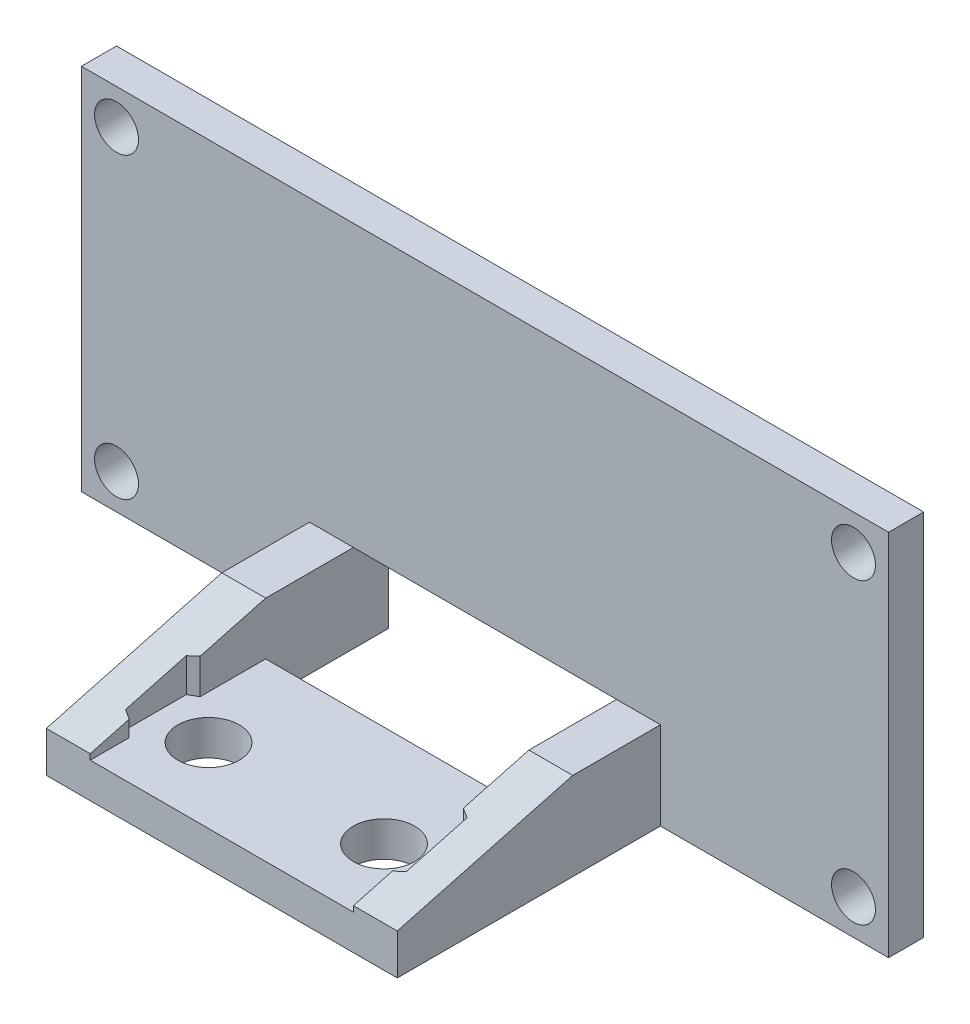
ISO-10303-21;
HEADER;
FILE_DESCRIPTION(('STEP AP214'),'2;1');
FILE_NAME('part.step','',(''),(''),'','','');
FILE_SCHEMA(('AUTOMOTIVE_DESIGN { 1 0 10303 214 1 1 1 1 }'));
ENDSEC;
DATA;
#1=APPLICATION_CONTEXT('core data for automotive mechanical design processes');
#2=APPLICATION_PROTOCOL_DEFINITION('international standard','automotive_design',2000,#1);
#3=PRODUCT_CONTEXT('',#1,'mechanical');
#4=PRODUCT('Part','Part','',(#3));
#5=PRODUCT_RELATED_PRODUCT_CATEGORY('part','',(#4));
#6=PRODUCT_DEFINITION_FORMATION('','',#4);
#7=PRODUCT_DEFINITION_CONTEXT('part definition',#1,'design');
#8=PRODUCT_DEFINITION('design','',#6,#7);
#9=PRODUCT_DEFINITION_SHAPE('','',#8);
#10=(LENGTH_UNIT() NAMED_UNIT(*) SI_UNIT(.MILLI.,.METRE.));
#11=(NAMED_UNIT(*) PLANE_ANGLE_UNIT() SI_UNIT($,.RADIAN.));
#12=(NAMED_UNIT(*) SI_UNIT($,.STERADIAN.) SOLID_ANGLE_UNIT());
#13=UNCERTAINTY_MEASURE_WITH_UNIT(LENGTH_MEASURE(1.E-05),#10,'distance_accuracy_value','');
#14=(GEOMETRIC_REPRESENTATION_CONTEXT(3) GLOBAL_UNCERTAINTY_ASSIGNED_CONTEXT((#13)) GLOBAL_UNIT_ASSIGNED_CONTEXT((#10,
#11,#12)) REPRESENTATION_CONTEXT('',''));
#15=CARTESIAN_POINT('',(0.,0.,0.));
#16=DIRECTION('',(0.,0.,1.));
#17=DIRECTION('',(1.,0.,0.));
#18=AXIS2_PLACEMENT_3D('',#15,#16,#17);
#19=CARTESIAN_POINT('',(7.5,0.,2.));
#20=DIRECTION('',(1.,0.,0.));
#21=DIRECTION('',(0.,1.,0.));
#22=AXIS2_PLACEMENT_3D('',#19,#20,#21);
#23=PLANE('',#22);
#24=DIRECTION('',(0.,1.,0.));
#25=VECTOR('',#24,1.);
#26=CARTESIAN_POINT('',(7.5,0.,14.7766332552221));
#27=LINE('',#26,#25);
#28=CARTESIAN_POINT('',(7.5,-8.5,14.7766332552221));
#29=VERTEX_POINT('',#28);
#30=CARTESIAN_POINT('',(7.5,-7.5837426005698,14.7766332552221));
#31=VERTEX_POINT('',#30);
#32=EDGE_CURVE('E271',#29,#31,#27,.T.);
#33=ORIENTED_EDGE('',*,*,#32,.F.);
#34=DIRECTION('',(0.,0.,1.));
#35=VECTOR('',#34,1.);
#36=CARTESIAN_POINT('',(7.5,-8.5,7.));
#37=LINE('',#36,#35);
#38=CARTESIAN_POINT('',(7.5,-8.5,17.));
#39=VERTEX_POINT('',#38);
#40=EDGE_CURVE('E232',#29,#39,#37,.T.);
#41=ORIENTED_EDGE('',*,*,#40,.T.);
#42=DIRECTION('',(0.,-1.,0.));
#43=VECTOR('',#42,1.);
#44=CARTESIAN_POINT('',(7.5,-10.5,17.));
#45=LINE('',#44,#43);
#46=CARTESIAN_POINT('',(7.5,-8.17949192431123,17.));
#47=VERTEX_POINT('',#46);
#48=EDGE_CURVE('E366',#47,#39,#45,.T.);
#49=ORIENTED_EDGE('',*,*,#48,.F.);
#50=DIRECTION('',(0.,-0.258819045102518,0.965925826289069));
#51=VECTOR('',#50,1.);
#52=CARTESIAN_POINT('',(7.5,-8.17949192431123,17.));
#53=LINE('',#52,#51);
#54=EDGE_CURVE('E486',#47,#31,#53,.F.);
#55=ORIENTED_EDGE('',*,*,#54,.T.);
#56=EDGE_LOOP('',(#33,#41,#49,#55));
#57=FACE_BOUND('',#56,.T.);
#58=ADVANCED_FACE('F45',(#57),#23,.F.);
#59=DIRECTION('',(0.,-1.,0.));
#60=VECTOR('',#59,1.);
#61=CARTESIAN_POINT('',(7.5,0.,10.7351813708948));
#62=LINE('',#61,#60);
#63=CARTESIAN_POINT('',(7.5,-6.50083883191505,10.7351813708947));
#64=VERTEX_POINT('',#63);
#65=CARTESIAN_POINT('',(7.5,-8.5,10.7351813708948));
#66=VERTEX_POINT('',#65);
#67=EDGE_CURVE('E268',#64,#66,#62,.T.);
#68=ORIENTED_EDGE('',*,*,#67,.F.);
#69=CARTESIAN_POINT('',(7.5,-5.5,6.99999999999987));
#70=VERTEX_POINT('',#69);
#71=EDGE_CURVE('E485',#64,#70,#53,.F.);
#72=ORIENTED_EDGE('',*,*,#71,.T.);
#73=DIRECTION('',(0.,0.,-1.));
#74=VECTOR('',#73,1.);
#75=CARTESIAN_POINT('',(7.5,-5.5,17.));
#76=LINE('',#75,#74);
#77=CARTESIAN_POINT('',(7.5,-5.5,2.));
#78=VERTEX_POINT('',#77);
#79=EDGE_CURVE('E357',#70,#78,#76,.T.);
#80=ORIENTED_EDGE('',*,*,#79,.T.);
#81=DIRECTION('',(0.,0.,-1.));
#82=VECTOR('',#81,1.);
#83=CARTESIAN_POINT('',(7.5,-5.5,2.));
#84=LINE('',#83,#82);
#85=CARTESIAN_POINT('',(7.5,-5.5,0.));
#86=VERTEX_POINT('',#85);
#87=EDGE_CURVE('E473',#78,#86,#84,.T.);
#88=ORIENTED_EDGE('',*,*,#87,.T.);
#89=DIRECTION('',(0.,-1.,0.));
#90=VECTOR('',#89,1.);
#91=CARTESIAN_POINT('',(7.5,0.,0.));
#92=LINE('',#91,#90);
#93=CARTESIAN_POINT('',(7.5,-10.5,0.));
#94=VERTEX_POINT('',#93);
#95=EDGE_CURVE('E428',#86,#94,#92,.T.);
#96=ORIENTED_EDGE('',*,*,#95,.T.);
#97=DIRECTION('',(0.,0.,-1.));
#98=VECTOR('',#97,1.);
#99=CARTESIAN_POINT('',(7.5,-10.5,2.));
#100=LINE('',#99,#98);
#101=CARTESIAN_POINT('',(7.5,-10.5,7.));
#102=VERTEX_POINT('',#101);
#103=EDGE_CURVE('E470',#102,#94,#100,.T.);
#104=ORIENTED_EDGE('',*,*,#103,.F.);
#105=DIRECTION('',(0.,1.,0.));
#106=VECTOR('',#105,1.);
#107=CARTESIAN_POINT('',(7.5,-10.5,7.));
#108=LINE('',#107,#106);
#109=CARTESIAN_POINT('',(7.5,-8.5,7.));
#110=VERTEX_POINT('',#109);
#111=EDGE_CURVE('E331',#102,#110,#108,.T.);
#112=ORIENTED_EDGE('',*,*,#111,.T.);
#113=EDGE_CURVE('E348',#110,#66,#37,.T.);
#114=ORIENTED_EDGE('',*,*,#113,.T.);
#115=EDGE_LOOP('',(#68,#72,#80,#88,#96,#104,#112,#114));
#116=FACE_BOUND('',#115,.T.);
#117=ADVANCED_FACE('F530',(#116),#23,.F.);
#118=CARTESIAN_POINT('',(-7.5,0.,2.));
#119=DIRECTION('',(1.,0.,0.));
#120=DIRECTION('',(0.,0.,-1.));
#121=AXIS2_PLACEMENT_3D('',#118,#119,#120);
#122=PLANE('',#121);
#123=DIRECTION('',(0.,0.,1.));
#124=VECTOR('',#123,1.);
#125=CARTESIAN_POINT('',(-7.5,-8.5,7.));
#126=LINE('',#125,#124);
#127=CARTESIAN_POINT('',(-7.5,-8.5,14.7766332552221));
#128=VERTEX_POINT('',#127);
#129=CARTESIAN_POINT('',(-7.5,-8.5,17.));
#130=VERTEX_POINT('',#129);
#131=EDGE_CURVE('E347',#128,#130,#126,.T.);
#132=ORIENTED_EDGE('',*,*,#131,.F.);
#133=DIRECTION('',(0.,1.,0.));
#134=VECTOR('',#133,1.);
#135=CARTESIAN_POINT('',(-7.5,0.,14.7766332552221));
#136=LINE('',#135,#134);
#137=CARTESIAN_POINT('',(-7.5,-7.58374260056979,14.7766332552221));
#138=VERTEX_POINT('',#137);
#139=EDGE_CURVE('E264',#128,#138,#136,.T.);
#140=ORIENTED_EDGE('',*,*,#139,.T.);
#141=DIRECTION('',(0.,0.258819045102518,-0.965925826289069));
#142=VECTOR('',#141,1.);
#143=CARTESIAN_POINT('',(-7.5,-3.88156986040726,0.959936490538901));
#144=LINE('',#143,#142);
#145=CARTESIAN_POINT('',(-7.5,-8.17949192431123,17.));
#146=VERTEX_POINT('',#145);
#147=EDGE_CURVE('E502',#138,#146,#144,.F.);
#148=ORIENTED_EDGE('',*,*,#147,.T.);
#149=DIRECTION('',(0.,1.,0.));
#150=VECTOR('',#149,1.);
#151=CARTESIAN_POINT('',(-7.5,-10.5,17.));
#152=LINE('',#151,#150);
#153=EDGE_CURVE('E384',#130,#146,#152,.T.);
#154=ORIENTED_EDGE('',*,*,#153,.F.);
#155=EDGE_LOOP('',(#132,#140,#148,#154));
#156=FACE_BOUND('',#155,.T.);
#157=ADVANCED_FACE('F591',(#156),#122,.T.);
#158=CARTESIAN_POINT('',(-7.5,-5.5,6.99999999999987));
#159=VERTEX_POINT('',#158);
#160=CARTESIAN_POINT('',(-7.5,-6.50083883191505,10.7351813708948));
#161=VERTEX_POINT('',#160);
#162=EDGE_CURVE('E503',#159,#161,#144,.F.);
#163=ORIENTED_EDGE('',*,*,#162,.T.);
#164=DIRECTION('',(0.,-1.,0.));
#165=VECTOR('',#164,1.);
#166=CARTESIAN_POINT('',(-7.5,0.,10.7351813708948));
#167=LINE('',#166,#165);
#168=CARTESIAN_POINT('',(-7.5,-8.5,10.7351813708948));
#169=VERTEX_POINT('',#168);
#170=EDGE_CURVE('E222',#161,#169,#167,.T.);
#171=ORIENTED_EDGE('',*,*,#170,.T.);
#172=CARTESIAN_POINT('',(-7.5,-8.5,7.));
#173=VERTEX_POINT('',#172);
#174=EDGE_CURVE('E342',#173,#169,#126,.T.);
#175=ORIENTED_EDGE('',*,*,#174,.F.);
#176=DIRECTION('',(0.,-1.,0.));
#177=VECTOR('',#176,1.);
#178=CARTESIAN_POINT('',(-7.5,-10.5,7.));
#179=LINE('',#178,#177);
#180=CARTESIAN_POINT('',(-7.5,-10.5,7.));
#181=VERTEX_POINT('',#180);
#182=EDGE_CURVE('E323',#173,#181,#179,.T.);
#183=ORIENTED_EDGE('',*,*,#182,.T.);
#184=DIRECTION('',(0.,0.,-1.));
#185=VECTOR('',#184,1.);
#186=CARTESIAN_POINT('',(-7.5,-10.5,2.));
#187=LINE('',#186,#185);
#188=CARTESIAN_POINT('',(-7.5,-10.5,0.));
#189=VERTEX_POINT('',#188);
#190=EDGE_CURVE('E454',#181,#189,#187,.T.);
#191=ORIENTED_EDGE('',*,*,#190,.T.);
#192=DIRECTION('',(0.,-1.,0.));
#193=VECTOR('',#192,1.);
#194=CARTESIAN_POINT('',(-7.5,0.,0.));
#195=LINE('',#194,#193);
#196=CARTESIAN_POINT('',(-7.5,-5.5,0.));
#197=VERTEX_POINT('',#196);
#198=EDGE_CURVE('E410',#197,#189,#195,.T.);
#199=ORIENTED_EDGE('',*,*,#198,.F.);
#200=DIRECTION('',(0.,0.,-1.));
#201=VECTOR('',#200,1.);
#202=CARTESIAN_POINT('',(-7.5,-5.5,2.));
#203=LINE('',#202,#201);
#204=CARTESIAN_POINT('',(-7.5,-5.5,2.));
#205=VERTEX_POINT('',#204);
#206=EDGE_CURVE('E451',#205,#197,#203,.T.);
#207=ORIENTED_EDGE('',*,*,#206,.F.);
#208=DIRECTION('',(0.,0.,-1.));
#209=VECTOR('',#208,1.);
#210=CARTESIAN_POINT('',(-7.5,-5.5,17.));
#211=LINE('',#210,#209);
#212=EDGE_CURVE('E397',#159,#205,#211,.T.);
#213=ORIENTED_EDGE('',*,*,#212,.F.);
#214=EDGE_LOOP('',(#163,#171,#175,#183,#191,#199,#207,#213));
#215=FACE_BOUND('',#214,.T.);
#216=ADVANCED_FACE('F539',(#215),#122,.T.);
#217=CARTESIAN_POINT('',(0.,-8.17949192431123,17.));
#218=DIRECTION('',(0.,-0.965925826289069,-0.258819045102518));
#219=DIRECTION('',(-1.,0.,0.));
#220=AXIS2_PLACEMENT_3D('',#217,#218,#219);
#221=PLANE('',#220);
#222=DIRECTION('',(0.,0.258819045102518,-0.965925826289069));
#223=VECTOR('',#222,1.);
#224=CARTESIAN_POINT('',(8.,-8.17949192431123,17.));
#225=LINE('',#224,#223);
#226=CARTESIAN_POINT('',(8.,-6.57818910110467,11.0238565054896));
#227=VERTEX_POINT('',#226);
#228=CARTESIAN_POINT('',(8.,-7.50639233138017,14.4879581206273));
#229=VERTEX_POINT('',#228);
#230=EDGE_CURVE('E55',#227,#229,#225,.F.);
#231=ORIENTED_EDGE('',*,*,#230,.T.);
#232=DIRECTION('',(0.858356263574049,0.132788176096107,-0.495572219835078));
#233=VECTOR('',#232,1.);
#234=CARTESIAN_POINT('',(0.960510458879897,-8.59540515330655,18.5522093021506));
#235=LINE('',#234,#233);
#236=EDGE_CURVE('E11',#229,#31,#235,.F.);
#237=ORIENTED_EDGE('',*,*,#236,.T.);
#238=ORIENTED_EDGE('',*,*,#54,.F.);
#239=DIRECTION('',(-1.,0.,0.));
#240=VECTOR('',#239,1.);
#241=CARTESIAN_POINT('',(0.,-8.17949192431123,17.));
#242=LINE('',#241,#240);
#243=CARTESIAN_POINT('',(10.,-8.17949192431123,17.));
#244=VERTEX_POINT('',#243);
#245=EDGE_CURVE('E481',#244,#47,#242,.T.);
#246=ORIENTED_EDGE('',*,*,#245,.F.);
#247=DIRECTION('',(0.,0.258819045102518,-0.965925826289069));
#248=VECTOR('',#247,1.);
#249=CARTESIAN_POINT('',(10.,-8.17949192431123,17.));
#250=LINE('',#249,#248);
#251=CARTESIAN_POINT('',(10.,-5.5,6.99999999999987));
#252=VERTEX_POINT('',#251);
#253=EDGE_CURVE('E493',#252,#244,#250,.F.);
#254=ORIENTED_EDGE('',*,*,#253,.F.);
#255=DIRECTION('',(1.,0.,0.));
#256=VECTOR('',#255,1.);
#257=CARTESIAN_POINT('',(7.5,-5.5,6.99999999999987));
#258=LINE('',#257,#256);
#259=EDGE_CURVE('E490',#70,#252,#258,.T.);
#260=ORIENTED_EDGE('',*,*,#259,.F.);
#261=ORIENTED_EDGE('',*,*,#71,.F.);
#262=DIRECTION('',(-0.858356263574049,0.132788176096107,-0.495572219835078));
#263=VECTOR('',#262,1.);
#264=CARTESIAN_POINT('',(4.83042908635046,-6.08785477433188,9.19390388527839));
#265=LINE('',#264,#263);
#266=EDGE_CURVE('E519',#64,#227,#265,.F.);
#267=ORIENTED_EDGE('',*,*,#266,.T.);
#268=EDGE_LOOP('',(#231,#237,#238,#246,#254,#260,#261,#267));
#269=FACE_BOUND('',#268,.T.);
#270=ADVANCED_FACE('F524',(#269),#221,.F.);
#271=CARTESIAN_POINT('',(0.,-8.17949192431123,17.));
#272=DIRECTION('',(0.,-0.965925826289069,-0.258819045102518));
#273=DIRECTION('',(-1.,0.,0.));
#274=AXIS2_PLACEMENT_3D('',#271,#272,#273);
#275=PLANE('',#274);
#276=ORIENTED_EDGE('',*,*,#147,.F.);
#277=DIRECTION('',(0.858356263574049,-0.132788176096107,0.495572219835078));
#278=VECTOR('',#277,1.);
#279=CARTESIAN_POINT('',(-0.960510458879895,-8.59540515330655,18.5522093021506));
#280=LINE('',#279,#278);
#281=CARTESIAN_POINT('',(-8.,-7.50639233138017,14.4879581206273));
#282=VERTEX_POINT('',#281);
#283=EDGE_CURVE('E515',#138,#282,#280,.F.);
#284=ORIENTED_EDGE('',*,*,#283,.T.);
#285=DIRECTION('',(0.,-0.258819045102518,0.965925826289069));
#286=VECTOR('',#285,1.);
#287=CARTESIAN_POINT('',(-8.,-8.17949192431123,17.));
#288=LINE('',#287,#286);
#289=CARTESIAN_POINT('',(-8.,-6.57818910110467,11.0238565054896));
#290=VERTEX_POINT('',#289);
#291=EDGE_CURVE('E507',#282,#290,#288,.F.);
#292=ORIENTED_EDGE('',*,*,#291,.T.);
#293=DIRECTION('',(-0.858356263574049,-0.132788176096107,0.495572219835078));
#294=VECTOR('',#293,1.);
#295=CARTESIAN_POINT('',(-4.83042908635046,-6.08785477433188,9.19390388527839));
#296=LINE('',#295,#294);
#297=EDGE_CURVE('E511',#290,#161,#296,.F.);
#298=ORIENTED_EDGE('',*,*,#297,.T.);
#299=ORIENTED_EDGE('',*,*,#162,.F.);
#300=DIRECTION('',(1.,0.,0.));
#301=VECTOR('',#300,1.);
#302=CARTESIAN_POINT('',(-10.,-5.5,6.99999999999987));
#303=LINE('',#302,#301);
#304=CARTESIAN_POINT('',(-10.,-5.5,6.99999999999987));
#305=VERTEX_POINT('',#304);
#306=EDGE_CURVE('E499',#305,#159,#303,.T.);
#307=ORIENTED_EDGE('',*,*,#306,.F.);
#308=DIRECTION('',(0.,-0.258819045102518,0.965925826289069));
#309=VECTOR('',#308,1.);
#310=CARTESIAN_POINT('',(-10.,-8.17949192431123,17.));
#311=LINE('',#310,#309);
#312=CARTESIAN_POINT('',(-10.,-8.17949192431123,17.));
#313=VERTEX_POINT('',#312);
#314=EDGE_CURVE('E496',#313,#305,#311,.F.);
#315=ORIENTED_EDGE('',*,*,#314,.F.);
#316=DIRECTION('',(-1.,0.,0.));
#317=VECTOR('',#316,1.);
#318=CARTESIAN_POINT('',(0.,-8.17949192431123,17.));
#319=LINE('',#318,#317);
#320=EDGE_CURVE('E477',#146,#313,#319,.T.);
#321=ORIENTED_EDGE('',*,*,#320,.F.);
#322=EDGE_LOOP('',(#276,#284,#292,#298,#299,#307,#315,#321));
#323=FACE_BOUND('',#322,.T.);
#324=ADVANCED_FACE('F48',(#323),#275,.F.);
#325=CARTESIAN_POINT('',(0.,0.,2.));
#326=DIRECTION('',(0.,0.,1.));
#327=DIRECTION('',(1.,0.,0.));
#328=AXIS2_PLACEMENT_3D('',#325,#326,#327);
#329=PLANE('',#328);
#330=CARTESIAN_POINT('',(-21.,-8.5,2.));
#331=DIRECTION('',(0.,0.,1.));
#332=DIRECTION('',(1.,0.,0.));
#333=AXIS2_PLACEMENT_3D('',#330,#331,#332);
#334=CIRCLE('',#333,1.25);
#335=CARTESIAN_POINT('',(-19.75,-8.5,2.));
#336=VERTEX_POINT('',#335);
#337=EDGE_CURVE('E318',#336,#336,#334,.T.);
#338=ORIENTED_EDGE('',*,*,#337,.F.);
#339=EDGE_LOOP('',(#338));
#340=FACE_BOUND('',#339,.T.);
#341=CARTESIAN_POINT('',(21.,8.5,2.));
#342=DIRECTION('',(0.,0.,1.));
#343=DIRECTION('',(1.,0.,0.));
#344=AXIS2_PLACEMENT_3D('',#341,#342,#343);
#345=CIRCLE('',#344,1.25);
#346=CARTESIAN_POINT('',(22.25,8.5,2.));
#347=VERTEX_POINT('',#346);
#348=EDGE_CURVE('E314',#347,#347,#345,.T.);
#349=ORIENTED_EDGE('',*,*,#348,.F.);
#350=EDGE_LOOP('',(#349));
#351=FACE_BOUND('',#350,.T.);
#352=CARTESIAN_POINT('',(21.,-8.5,2.));
#353=DIRECTION('',(0.,0.,1.));
#354=DIRECTION('',(1.,0.,0.));
#355=AXIS2_PLACEMENT_3D('',#352,#353,#354);
#356=CIRCLE('',#355,1.25);
#357=CARTESIAN_POINT('',(22.25,-8.5,2.));
#358=VERTEX_POINT('',#357);
#359=EDGE_CURVE('E310',#358,#358,#356,.T.);
#360=ORIENTED_EDGE('',*,*,#359,.F.);
#361=EDGE_LOOP('',(#360));
#362=FACE_BOUND('',#361,.T.);
#363=CARTESIAN_POINT('',(-21.,8.5,2.));
#364=DIRECTION('',(0.,0.,1.));
#365=DIRECTION('',(1.,0.,0.));
#366=AXIS2_PLACEMENT_3D('',#363,#364,#365);
#367=CIRCLE('',#366,1.25);
#368=CARTESIAN_POINT('',(-19.75,8.5,2.));
#369=VERTEX_POINT('',#368);
#370=EDGE_CURVE('E306',#369,#369,#367,.T.);
#371=ORIENTED_EDGE('',*,*,#370,.F.);
#372=EDGE_LOOP('',(#371));
#373=FACE_BOUND('',#372,.T.);
#374=DIRECTION('',(-1.,0.,0.));
#375=VECTOR('',#374,1.);
#376=CARTESIAN_POINT('',(7.5,-5.5,2.));
#377=LINE('',#376,#375);
#378=CARTESIAN_POINT('',(10.,-5.5,2.));
#379=VERTEX_POINT('',#378);
#380=EDGE_CURVE('E361',#379,#78,#377,.T.);
#381=ORIENTED_EDGE('',*,*,#380,.F.);
#382=DIRECTION('',(0.,1.,0.));
#383=VECTOR('',#382,1.);
#384=CARTESIAN_POINT('',(10.,-10.5,2.));
#385=LINE('',#384,#383);
#386=CARTESIAN_POINT('',(10.,-10.5,2.));
#387=VERTEX_POINT('',#386);
#388=EDGE_CURVE('E365',#387,#379,#385,.T.);
#389=ORIENTED_EDGE('',*,*,#388,.F.);
#390=DIRECTION('',(1.,0.,0.));
#391=VECTOR('',#390,1.);
#392=CARTESIAN_POINT('',(0.,-10.5,2.));
#393=LINE('',#392,#391);
#394=CARTESIAN_POINT('',(23.,-10.5,2.));
#395=VERTEX_POINT('',#394);
#396=EDGE_CURVE('E409',#387,#395,#393,.T.);
#397=ORIENTED_EDGE('',*,*,#396,.T.);
#398=DIRECTION('',(0.,-1.,0.));
#399=VECTOR('',#398,1.);
#400=CARTESIAN_POINT('',(23.,0.,2.));
#401=LINE('',#400,#399);
#402=CARTESIAN_POINT('',(23.,10.5,2.));
#403=VERTEX_POINT('',#402);
#404=EDGE_CURVE('E413',#403,#395,#401,.T.);
#405=ORIENTED_EDGE('',*,*,#404,.F.);
#406=DIRECTION('',(1.,0.,0.));
#407=VECTOR('',#406,1.);
#408=CARTESIAN_POINT('',(0.,10.5,2.));
#409=LINE('',#408,#407);
#410=CARTESIAN_POINT('',(-23.,10.5,2.));
#411=VERTEX_POINT('',#410);
#412=EDGE_CURVE('E418',#411,#403,#409,.T.);
#413=ORIENTED_EDGE('',*,*,#412,.F.);
#414=DIRECTION('',(0.,-1.,0.));
#415=VECTOR('',#414,1.);
#416=CARTESIAN_POINT('',(-23.,0.,2.));
#417=LINE('',#416,#415);
#418=CARTESIAN_POINT('',(-23.,-10.5,2.));
#419=VERTEX_POINT('',#418);
#420=EDGE_CURVE('E422',#411,#419,#417,.T.);
#421=ORIENTED_EDGE('',*,*,#420,.T.);
#422=CARTESIAN_POINT('',(-10.,-10.5,2.));
#423=VERTEX_POINT('',#422);
#424=EDGE_CURVE('E414',#419,#423,#393,.T.);
#425=ORIENTED_EDGE('',*,*,#424,.T.);
#426=DIRECTION('',(0.,-1.,0.));
#427=VECTOR('',#426,1.);
#428=CARTESIAN_POINT('',(-10.,-10.5,2.));
#429=LINE('',#428,#427);
#430=CARTESIAN_POINT('',(-10.,-5.5,2.));
#431=VERTEX_POINT('',#430);
#432=EDGE_CURVE('E370',#431,#423,#429,.T.);
#433=ORIENTED_EDGE('',*,*,#432,.F.);
#434=DIRECTION('',(-1.,0.,0.));
#435=VECTOR('',#434,1.);
#436=CARTESIAN_POINT('',(-10.,-5.5,2.));
#437=LINE('',#436,#435);
#438=EDGE_CURVE('E381',#205,#431,#437,.T.);
#439=ORIENTED_EDGE('',*,*,#438,.F.);
#440=DIRECTION('',(1.,0.,0.));
#441=VECTOR('',#440,1.);
#442=CARTESIAN_POINT('',(0.,-5.5,2.));
#443=LINE('',#442,#441);
#444=EDGE_CURVE('E405',#205,#78,#443,.T.);
#445=ORIENTED_EDGE('',*,*,#444,.T.);
#446=EDGE_LOOP('',(#381,#389,#397,#405,#413,#421,#425,#433,#439,#445));
#447=FACE_BOUND('',#446,.T.);
#448=ADVANCED_FACE('F562',(#340,#351,#362,#373,#447),#329,.T.);
#449=CARTESIAN_POINT('',(0.,-5.5,2.));
#450=DIRECTION('',(0.,1.,0.));
#451=DIRECTION('',(0.,0.,1.));
#452=AXIS2_PLACEMENT_3D('',#449,#450,#451);
#453=PLANE('',#452);
#454=DIRECTION('',(1.,0.,0.));
#455=VECTOR('',#454,1.);
#456=CARTESIAN_POINT('',(0.,-5.5,0.));
#457=LINE('',#456,#455);
#458=EDGE_CURVE('E404',#197,#86,#457,.T.);
#459=ORIENTED_EDGE('',*,*,#458,.T.);
#460=ORIENTED_EDGE('',*,*,#87,.F.);
#461=ORIENTED_EDGE('',*,*,#444,.F.);
#462=ORIENTED_EDGE('',*,*,#206,.T.);
#463=EDGE_LOOP('',(#459,#460,#461,#462));
#464=FACE_BOUND('',#463,.T.);
#465=ADVANCED_FACE('F558',(#464),#453,.F.);
#466=CARTESIAN_POINT('',(23.,0.,2.));
#467=DIRECTION('',(1.,0.,0.));
#468=DIRECTION('',(0.,1.,0.));
#469=AXIS2_PLACEMENT_3D('',#466,#467,#468);
#470=PLANE('',#469);
#471=DIRECTION('',(0.,-1.,0.));
#472=VECTOR('',#471,1.);
#473=CARTESIAN_POINT('',(23.,0.,0.));
#474=LINE('',#473,#472);
#475=CARTESIAN_POINT('',(23.,10.5,0.));
#476=VERTEX_POINT('',#475);
#477=CARTESIAN_POINT('',(23.,-10.5,0.));
#478=VERTEX_POINT('',#477);
#479=EDGE_CURVE('E436',#476,#478,#474,.T.);
#480=ORIENTED_EDGE('',*,*,#479,.F.);
#481=DIRECTION('',(0.,0.,-1.));
#482=VECTOR('',#481,1.);
#483=CARTESIAN_POINT('',(23.,10.5,2.));
#484=LINE('',#483,#482);
#485=EDGE_CURVE('E464',#403,#476,#484,.T.);
#486=ORIENTED_EDGE('',*,*,#485,.F.);
#487=ORIENTED_EDGE('',*,*,#404,.T.);
#488=DIRECTION('',(0.,0.,-1.));
#489=VECTOR('',#488,1.);
#490=CARTESIAN_POINT('',(23.,-10.5,2.));
#491=LINE('',#490,#489);
#492=EDGE_CURVE('E467',#395,#478,#491,.T.);
#493=ORIENTED_EDGE('',*,*,#492,.T.);
#494=EDGE_LOOP('',(#480,#486,#487,#493));
#495=FACE_BOUND('',#494,.T.);
#496=ADVANCED_FACE('F611',(#495),#470,.T.);
#497=CARTESIAN_POINT('',(0.,10.5,2.));
#498=DIRECTION('',(0.,1.,0.));
#499=DIRECTION('',(0.,0.,1.));
#500=AXIS2_PLACEMENT_3D('',#497,#498,#499);
#501=PLANE('',#500);
#502=DIRECTION('',(1.,0.,0.));
#503=VECTOR('',#502,1.);
#504=CARTESIAN_POINT('',(0.,10.5,0.));
#505=LINE('',#504,#503);
#506=CARTESIAN_POINT('',(-23.,10.5,0.));
#507=VERTEX_POINT('',#506);
#508=EDGE_CURVE('E441',#507,#476,#505,.T.);
#509=ORIENTED_EDGE('',*,*,#508,.F.);
#510=DIRECTION('',(0.,0.,-1.));
#511=VECTOR('',#510,1.);
#512=CARTESIAN_POINT('',(-23.,10.5,2.));
#513=LINE('',#512,#511);
#514=EDGE_CURVE('E461',#411,#507,#513,.T.);
#515=ORIENTED_EDGE('',*,*,#514,.F.);
#516=ORIENTED_EDGE('',*,*,#412,.T.);
#517=ORIENTED_EDGE('',*,*,#485,.T.);
#518=EDGE_LOOP('',(#509,#515,#516,#517));
#519=FACE_BOUND('',#518,.T.);
#520=ADVANCED_FACE('F615',(#519),#501,.T.);
#521=CARTESIAN_POINT('',(-23.,0.,2.));
#522=DIRECTION('',(1.,0.,0.));
#523=DIRECTION('',(0.,1.,0.));
#524=AXIS2_PLACEMENT_3D('',#521,#522,#523);
#525=PLANE('',#524);
#526=DIRECTION('',(0.,-1.,0.));
#527=VECTOR('',#526,1.);
#528=CARTESIAN_POINT('',(-23.,0.,0.));
#529=LINE('',#528,#527);
#530=CARTESIAN_POINT('',(-23.,-10.5,0.));
#531=VERTEX_POINT('',#530);
#532=EDGE_CURVE('E445',#507,#531,#529,.T.);
#533=ORIENTED_EDGE('',*,*,#532,.T.);
#534=DIRECTION('',(0.,0.,-1.));
#535=VECTOR('',#534,1.);
#536=CARTESIAN_POINT('',(-23.,-10.5,2.));
#537=LINE('',#536,#535);
#538=EDGE_CURVE('E457',#419,#531,#537,.T.);
#539=ORIENTED_EDGE('',*,*,#538,.F.);
#540=ORIENTED_EDGE('',*,*,#420,.F.);
#541=ORIENTED_EDGE('',*,*,#514,.T.);
#542=EDGE_LOOP('',(#533,#539,#540,#541));
#543=FACE_BOUND('',#542,.T.);
#544=ADVANCED_FACE('F618',(#543),#525,.F.);
#545=CARTESIAN_POINT('',(0.,-10.5,2.));
#546=DIRECTION('',(0.,1.,0.));
#547=DIRECTION('',(0.,0.,1.));
#548=AXIS2_PLACEMENT_3D('',#545,#546,#547);
#549=PLANE('',#548);
#550=CARTESIAN_POINT('',(-5.,-10.5,12.7559073130584));
#551=DIRECTION('',(0.,1.,0.));
#552=DIRECTION('',(0.,0.,1.));
#553=AXIS2_PLACEMENT_3D('',#550,#551,#552);
#554=CIRCLE('',#553,1.75);
#555=CARTESIAN_POINT('',(-5.,-10.5,14.5059073130584));
#556=VERTEX_POINT('',#555);
#557=EDGE_CURVE('E275',#556,#556,#554,.T.);
#558=ORIENTED_EDGE('',*,*,#557,.T.);
#559=EDGE_LOOP('',(#558));
#560=FACE_BOUND('',#559,.T.);
#561=CARTESIAN_POINT('',(5.,-10.5,12.7559073130584));
#562=DIRECTION('',(0.,1.,0.));
#563=DIRECTION('',(0.,0.,1.));
#564=AXIS2_PLACEMENT_3D('',#561,#562,#563);
#565=CIRCLE('',#564,1.75);
#566=CARTESIAN_POINT('',(5.,-10.5,14.5059073130584));
#567=VERTEX_POINT('',#566);
#568=EDGE_CURVE('E274',#567,#567,#565,.T.);
#569=ORIENTED_EDGE('',*,*,#568,.T.);
#570=EDGE_LOOP('',(#569));
#571=FACE_BOUND('',#570,.T.);
#572=DIRECTION('',(1.,0.,0.));
#573=VECTOR('',#572,1.);
#574=CARTESIAN_POINT('',(0.,-10.5,0.));
#575=LINE('',#574,#573);
#576=EDGE_CURVE('E437',#531,#189,#575,.T.);
#577=ORIENTED_EDGE('',*,*,#576,.T.);
#578=ORIENTED_EDGE('',*,*,#190,.F.);
#579=DIRECTION('',(1.,0.,0.));
#580=VECTOR('',#579,1.);
#581=CARTESIAN_POINT('',(-7.5,-10.5,7.));
#582=LINE('',#581,#580);
#583=EDGE_CURVE('E327',#181,#102,#582,.T.);
#584=ORIENTED_EDGE('',*,*,#583,.T.);
#585=ORIENTED_EDGE('',*,*,#103,.T.);
#586=EDGE_CURVE('E432',#94,#478,#575,.T.);
#587=ORIENTED_EDGE('',*,*,#586,.T.);
#588=ORIENTED_EDGE('',*,*,#492,.F.);
#589=ORIENTED_EDGE('',*,*,#396,.F.);
#590=DIRECTION('',(0.,0.,-1.));
#591=VECTOR('',#590,1.);
#592=CARTESIAN_POINT('',(10.,-10.5,17.));
#593=LINE('',#592,#591);
#594=CARTESIAN_POINT('',(10.,-10.5,17.));
#595=VERTEX_POINT('',#594);
#596=EDGE_CURVE('E346',#595,#387,#593,.T.);
#597=ORIENTED_EDGE('',*,*,#596,.F.);
#598=DIRECTION('',(1.,0.,0.));
#599=VECTOR('',#598,1.);
#600=CARTESIAN_POINT('',(-10.,-10.5,17.));
#601=LINE('',#600,#599);
#602=CARTESIAN_POINT('',(-10.,-10.5,17.));
#603=VERTEX_POINT('',#602);
#604=EDGE_CURVE('E380',#603,#595,#601,.T.);
#605=ORIENTED_EDGE('',*,*,#604,.F.);
#606=DIRECTION('',(0.,0.,-1.));
#607=VECTOR('',#606,1.);
#608=CARTESIAN_POINT('',(-10.,-10.5,17.));
#609=LINE('',#608,#607);
#610=EDGE_CURVE('E400',#603,#423,#609,.T.);
#611=ORIENTED_EDGE('',*,*,#610,.T.);
#612=ORIENTED_EDGE('',*,*,#424,.F.);
#613=ORIENTED_EDGE('',*,*,#538,.T.);
#614=EDGE_LOOP('',(#577,#578,#584,#585,#587,#588,#589,#597,#605,#611,#612,#613));
#615=FACE_BOUND('',#614,.T.);
#616=ADVANCED_FACE('F543',(#560,#571,#615),#549,.F.);
#617=CARTESIAN_POINT('',(0.,0.,0.));
#618=DIRECTION('',(0.,0.,1.));
#619=DIRECTION('',(1.,0.,0.));
#620=AXIS2_PLACEMENT_3D('',#617,#618,#619);
#621=PLANE('',#620);
#622=CARTESIAN_POINT('',(-21.,-8.5,0.));
#623=DIRECTION('',(0.,0.,-1.));
#624=DIRECTION('',(-1.,0.,0.));
#625=AXIS2_PLACEMENT_3D('',#622,#623,#624);
#626=CIRCLE('',#625,1.25);
#627=CARTESIAN_POINT('',(-22.25,-8.5,0.));
#628=VERTEX_POINT('',#627);
#629=EDGE_CURVE('E279',#628,#628,#626,.T.);
#630=ORIENTED_EDGE('',*,*,#629,.F.);
#631=EDGE_LOOP('',(#630));
#632=FACE_BOUND('',#631,.T.);
#633=CARTESIAN_POINT('',(21.,8.5,0.));
#634=DIRECTION('',(0.,0.,-1.));
#635=DIRECTION('',(-1.,0.,0.));
#636=AXIS2_PLACEMENT_3D('',#633,#634,#635);
#637=CIRCLE('',#636,1.25);
#638=CARTESIAN_POINT('',(19.75,8.5,0.));
#639=VERTEX_POINT('',#638);
#640=EDGE_CURVE('E296',#639,#639,#637,.T.);
#641=ORIENTED_EDGE('',*,*,#640,.F.);
#642=EDGE_LOOP('',(#641));
#643=FACE_BOUND('',#642,.T.);
#644=CARTESIAN_POINT('',(21.,-8.5,0.));
#645=DIRECTION('',(0.,0.,-1.));
#646=DIRECTION('',(-1.,0.,0.));
#647=AXIS2_PLACEMENT_3D('',#644,#645,#646);
#648=CIRCLE('',#647,1.25);
#649=CARTESIAN_POINT('',(19.75,-8.5,0.));
#650=VERTEX_POINT('',#649);
#651=EDGE_CURVE('E291',#650,#650,#648,.T.);
#652=ORIENTED_EDGE('',*,*,#651,.F.);
#653=EDGE_LOOP('',(#652));
#654=FACE_BOUND('',#653,.T.);
#655=CARTESIAN_POINT('',(-21.,8.5,0.));
#656=DIRECTION('',(0.,0.,-1.));
#657=DIRECTION('',(-1.,0.,0.));
#658=AXIS2_PLACEMENT_3D('',#655,#656,#657);
#659=CIRCLE('',#658,1.25);
#660=CARTESIAN_POINT('',(-22.25,8.5,0.));
#661=VERTEX_POINT('',#660);
#662=EDGE_CURVE('E295',#661,#661,#659,.T.);
#663=ORIENTED_EDGE('',*,*,#662,.F.);
#664=EDGE_LOOP('',(#663));
#665=FACE_BOUND('',#664,.T.);
#666=ORIENTED_EDGE('',*,*,#458,.F.);
#667=ORIENTED_EDGE('',*,*,#198,.T.);
#668=ORIENTED_EDGE('',*,*,#576,.F.);
#669=ORIENTED_EDGE('',*,*,#532,.F.);
#670=ORIENTED_EDGE('',*,*,#508,.T.);
#671=ORIENTED_EDGE('',*,*,#479,.T.);
#672=ORIENTED_EDGE('',*,*,#586,.F.);
#673=ORIENTED_EDGE('',*,*,#95,.F.);
#674=EDGE_LOOP('',(#666,#667,#668,#669,#670,#671,#672,#673));
#675=FACE_BOUND('',#674,.T.);
#676=ADVANCED_FACE('F551',(#632,#643,#654,#665,#675),#621,.F.);
#677=CARTESIAN_POINT('',(-10.,-10.5,17.));
#678=DIRECTION('',(1.,0.,0.));
#679=DIRECTION('',(0.,0.,-1.));
#680=AXIS2_PLACEMENT_3D('',#677,#678,#679);
#681=PLANE('',#680);
#682=DIRECTION('',(0.,-1.,0.));
#683=VECTOR('',#682,1.);
#684=CARTESIAN_POINT('',(-10.,-10.5,17.));
#685=LINE('',#684,#683);
#686=EDGE_CURVE('E377',#313,#603,#685,.T.);
#687=ORIENTED_EDGE('',*,*,#686,.F.);
#688=ORIENTED_EDGE('',*,*,#314,.T.);
#689=DIRECTION('',(0.,0.,-1.));
#690=VECTOR('',#689,1.);
#691=CARTESIAN_POINT('',(-10.,-5.5,17.));
#692=LINE('',#691,#690);
#693=EDGE_CURVE('E388',#305,#431,#692,.T.);
#694=ORIENTED_EDGE('',*,*,#693,.T.);
#695=ORIENTED_EDGE('',*,*,#432,.T.);
#696=ORIENTED_EDGE('',*,*,#610,.F.);
#697=EDGE_LOOP('',(#687,#688,#694,#695,#696));
#698=FACE_BOUND('',#697,.T.);
#699=ADVANCED_FACE('F596',(#698),#681,.F.);
#700=CARTESIAN_POINT('',(-10.,-5.5,17.));
#701=DIRECTION('',(0.,-1.,0.));
#702=DIRECTION('',(0.,0.,-1.));
#703=AXIS2_PLACEMENT_3D('',#700,#701,#702);
#704=PLANE('',#703);
#705=ORIENTED_EDGE('',*,*,#693,.F.);
#706=ORIENTED_EDGE('',*,*,#306,.T.);
#707=ORIENTED_EDGE('',*,*,#212,.T.);
#708=ORIENTED_EDGE('',*,*,#438,.T.);
#709=EDGE_LOOP('',(#705,#706,#707,#708));
#710=FACE_BOUND('',#709,.T.);
#711=ADVANCED_FACE('F567',(#710),#704,.F.);
#712=CARTESIAN_POINT('',(0.,0.,17.));
#713=DIRECTION('',(0.,0.,-1.));
#714=DIRECTION('',(-1.,0.,0.));
#715=AXIS2_PLACEMENT_3D('',#712,#713,#714);
#716=PLANE('',#715);
#717=DIRECTION('',(0.,1.,0.));
#718=VECTOR('',#717,1.);
#719=CARTESIAN_POINT('',(10.,-10.5,17.));
#720=LINE('',#719,#718);
#721=EDGE_CURVE('E360',#595,#244,#720,.T.);
#722=ORIENTED_EDGE('',*,*,#721,.T.);
#723=ORIENTED_EDGE('',*,*,#245,.T.);
#724=ORIENTED_EDGE('',*,*,#48,.T.);
#725=DIRECTION('',(-1.,0.,0.));
#726=VECTOR('',#725,1.);
#727=CARTESIAN_POINT('',(-7.5,-8.5,17.));
#728=LINE('',#727,#726);
#729=EDGE_CURVE('E322',#39,#130,#728,.T.);
#730=ORIENTED_EDGE('',*,*,#729,.T.);
#731=ORIENTED_EDGE('',*,*,#153,.T.);
#732=ORIENTED_EDGE('',*,*,#320,.T.);
#733=ORIENTED_EDGE('',*,*,#686,.T.);
#734=ORIENTED_EDGE('',*,*,#604,.T.);
#735=EDGE_LOOP('',(#722,#723,#724,#730,#731,#732,#733,#734));
#736=FACE_BOUND('',#735,.T.);
#737=ADVANCED_FACE('F588',(#736),#716,.F.);
#738=CARTESIAN_POINT('',(10.,-10.5,17.));
#739=DIRECTION('',(-1.,0.,0.));
#740=DIRECTION('',(0.,0.,1.));
#741=AXIS2_PLACEMENT_3D('',#738,#739,#740);
#742=PLANE('',#741);
#743=DIRECTION('',(0.,0.,-1.));
#744=VECTOR('',#743,1.);
#745=CARTESIAN_POINT('',(10.,-5.5,17.));
#746=LINE('',#745,#744);
#747=EDGE_CURVE('E354',#252,#379,#746,.T.);
#748=ORIENTED_EDGE('',*,*,#747,.F.);
#749=ORIENTED_EDGE('',*,*,#253,.T.);
#750=ORIENTED_EDGE('',*,*,#721,.F.);
#751=ORIENTED_EDGE('',*,*,#596,.T.);
#752=ORIENTED_EDGE('',*,*,#388,.T.);
#753=EDGE_LOOP('',(#748,#749,#750,#751,#752));
#754=FACE_BOUND('',#753,.T.);
#755=ADVANCED_FACE('F603',(#754),#742,.F.);
#756=CARTESIAN_POINT('',(7.5,-5.5,17.));
#757=DIRECTION('',(0.,-1.,0.));
#758=DIRECTION('',(0.,0.,-1.));
#759=AXIS2_PLACEMENT_3D('',#756,#757,#758);
#760=PLANE('',#759);
#761=ORIENTED_EDGE('',*,*,#79,.F.);
#762=ORIENTED_EDGE('',*,*,#259,.T.);
#763=ORIENTED_EDGE('',*,*,#747,.T.);
#764=ORIENTED_EDGE('',*,*,#380,.T.);
#765=EDGE_LOOP('',(#761,#762,#763,#764));
#766=FACE_BOUND('',#765,.T.);
#767=ADVANCED_FACE('F605',(#766),#760,.F.);
#768=CARTESIAN_POINT('',(-7.5,-8.5,7.));
#769=DIRECTION('',(0.,1.,0.));
#770=DIRECTION('',(0.,0.,1.));
#771=AXIS2_PLACEMENT_3D('',#768,#769,#770);
#772=PLANE('',#771);
#773=ORIENTED_EDGE('',*,*,#40,.F.);
#774=DIRECTION('',(0.866025403784439,0.,-0.5));
#775=VECTOR('',#774,1.);
#776=CARTESIAN_POINT('',(5.,-8.5,16.2200089281962));
#777=LINE('',#776,#775);
#778=CARTESIAN_POINT('',(8.,-8.5,14.4879581206273));
#779=VERTEX_POINT('',#778);
#780=EDGE_CURVE('E216',#29,#779,#777,.T.);
#781=ORIENTED_EDGE('',*,*,#780,.T.);
#782=DIRECTION('',(0.,0.,-1.));
#783=VECTOR('',#782,1.);
#784=CARTESIAN_POINT('',(8.,-8.5,14.4879581206273));
#785=LINE('',#784,#783);
#786=CARTESIAN_POINT('',(8.,-8.5,11.0238565054896));
#787=VERTEX_POINT('',#786);
#788=EDGE_CURVE('E230',#779,#787,#785,.T.);
#789=ORIENTED_EDGE('',*,*,#788,.T.);
#790=DIRECTION('',(-0.866025403784439,0.,-0.5));
#791=VECTOR('',#790,1.);
#792=CARTESIAN_POINT('',(8.,-8.5,11.0238565054896));
#793=LINE('',#792,#791);
#794=EDGE_CURVE('E238',#787,#66,#793,.T.);
#795=ORIENTED_EDGE('',*,*,#794,.T.);
#796=ORIENTED_EDGE('',*,*,#113,.F.);
#797=DIRECTION('',(-1.,0.,0.));
#798=VECTOR('',#797,1.);
#799=CARTESIAN_POINT('',(-7.5,-8.5,7.));
#800=LINE('',#799,#798);
#801=EDGE_CURVE('E335',#110,#173,#800,.T.);
#802=ORIENTED_EDGE('',*,*,#801,.T.);
#803=ORIENTED_EDGE('',*,*,#174,.T.);
#804=DIRECTION('',(-0.866025403784439,0.,0.5));
#805=VECTOR('',#804,1.);
#806=CARTESIAN_POINT('',(-5.,-8.5,9.29180569792069));
#807=LINE('',#806,#805);
#808=CARTESIAN_POINT('',(-8.,-8.5,11.0238565054896));
#809=VERTEX_POINT('',#808);
#810=EDGE_CURVE('E254',#169,#809,#807,.T.);
#811=ORIENTED_EDGE('',*,*,#810,.T.);
#812=DIRECTION('',(0.,0.,1.));
#813=VECTOR('',#812,1.);
#814=CARTESIAN_POINT('',(-8.,-8.5,11.0238565054896));
#815=LINE('',#814,#813);
#816=CARTESIAN_POINT('',(-8.,-8.5,14.4879581206273));
#817=VERTEX_POINT('',#816);
#818=EDGE_CURVE('E250',#809,#817,#815,.T.);
#819=ORIENTED_EDGE('',*,*,#818,.T.);
#820=DIRECTION('',(0.866025403784439,0.,0.5));
#821=VECTOR('',#820,1.);
#822=CARTESIAN_POINT('',(-8.,-8.5,14.4879581206273));
#823=LINE('',#822,#821);
#824=EDGE_CURVE('E234',#817,#128,#823,.T.);
#825=ORIENTED_EDGE('',*,*,#824,.T.);
#826=ORIENTED_EDGE('',*,*,#131,.T.);
#827=ORIENTED_EDGE('',*,*,#729,.F.);
#828=EDGE_LOOP('',(#773,#781,#789,#795,#796,#802,#803,#811,#819,#825,#826,#827));
#829=FACE_BOUND('',#828,.T.);
#830=CARTESIAN_POINT('',(-5.,-8.5,12.7559073130584));
#831=DIRECTION('',(0.,1.,0.));
#832=DIRECTION('',(0.,0.,1.));
#833=AXIS2_PLACEMENT_3D('',#830,#831,#832);
#834=CIRCLE('',#833,1.75);
#835=CARTESIAN_POINT('',(-5.,-8.5,14.5059073130584));
#836=VERTEX_POINT('',#835);
#837=EDGE_CURVE('E280',#836,#836,#834,.T.);
#838=ORIENTED_EDGE('',*,*,#837,.F.);
#839=EDGE_LOOP('',(#838));
#840=FACE_BOUND('',#839,.T.);
#841=CARTESIAN_POINT('',(5.,-8.5,12.7559073130584));
#842=DIRECTION('',(0.,1.,0.));
#843=DIRECTION('',(0.,0.,1.));
#844=AXIS2_PLACEMENT_3D('',#841,#842,#843);
#845=CIRCLE('',#844,1.75);
#846=CARTESIAN_POINT('',(5.,-8.5,14.5059073130584));
#847=VERTEX_POINT('',#846);
#848=EDGE_CURVE('E284',#847,#847,#845,.T.);
#849=ORIENTED_EDGE('',*,*,#848,.F.);
#850=EDGE_LOOP('',(#849));
#851=FACE_BOUND('',#850,.T.);
#852=ADVANCED_FACE('F227',(#829,#840,#851),#772,.T.);
#853=CARTESIAN_POINT('',(0.,0.,7.));
#854=DIRECTION('',(0.,0.,-1.));
#855=DIRECTION('',(-1.,0.,0.));
#856=AXIS2_PLACEMENT_3D('',#853,#854,#855);
#857=PLANE('',#856);
#858=ORIENTED_EDGE('',*,*,#182,.F.);
#859=ORIENTED_EDGE('',*,*,#801,.F.);
#860=ORIENTED_EDGE('',*,*,#111,.F.);
#861=ORIENTED_EDGE('',*,*,#583,.F.);
#862=EDGE_LOOP('',(#858,#859,#860,#861));
#863=FACE_BOUND('',#862,.T.);
#864=ADVANCED_FACE('F536',(#863),#857,.T.);
#865=CARTESIAN_POINT('',(-21.,8.5,17.));
#866=DIRECTION('',(0.,0.,-1.));
#867=DIRECTION('',(-1.,0.,0.));
#868=AXIS2_PLACEMENT_3D('',#865,#866,#867);
#869=CYLINDRICAL_SURFACE('',#868,1.25);
#870=ORIENTED_EDGE('',*,*,#370,.T.);
#871=EDGE_LOOP('',(#870));
#872=FACE_BOUND('',#871,.T.);
#873=ORIENTED_EDGE('',*,*,#662,.T.);
#874=EDGE_LOOP('',(#873));
#875=FACE_BOUND('',#874,.T.);
#876=ADVANCED_FACE('F669',(#872,#875),#869,.F.);
#877=CARTESIAN_POINT('',(21.,-8.5,17.));
#878=DIRECTION('',(0.,0.,-1.));
#879=DIRECTION('',(-1.,0.,0.));
#880=AXIS2_PLACEMENT_3D('',#877,#878,#879);
#881=CYLINDRICAL_SURFACE('',#880,1.25);
#882=ORIENTED_EDGE('',*,*,#359,.T.);
#883=EDGE_LOOP('',(#882));
#884=FACE_BOUND('',#883,.T.);
#885=ORIENTED_EDGE('',*,*,#651,.T.);
#886=EDGE_LOOP('',(#885));
#887=FACE_BOUND('',#886,.T.);
#888=ADVANCED_FACE('F672',(#884,#887),#881,.F.);
#889=CARTESIAN_POINT('',(21.,8.5,17.));
#890=DIRECTION('',(0.,0.,-1.));
#891=DIRECTION('',(-1.,0.,0.));
#892=AXIS2_PLACEMENT_3D('',#889,#890,#891);
#893=CYLINDRICAL_SURFACE('',#892,1.25);
#894=ORIENTED_EDGE('',*,*,#348,.T.);
#895=EDGE_LOOP('',(#894));
#896=FACE_BOUND('',#895,.T.);
#897=ORIENTED_EDGE('',*,*,#640,.T.);
#898=EDGE_LOOP('',(#897));
#899=FACE_BOUND('',#898,.T.);
#900=ADVANCED_FACE('F678',(#896,#899),#893,.F.);
#901=CARTESIAN_POINT('',(-21.,-8.5,17.));
#902=DIRECTION('',(0.,0.,-1.));
#903=DIRECTION('',(-1.,0.,0.));
#904=AXIS2_PLACEMENT_3D('',#901,#902,#903);
#905=CYLINDRICAL_SURFACE('',#904,1.25);
#906=ORIENTED_EDGE('',*,*,#337,.T.);
#907=EDGE_LOOP('',(#906));
#908=FACE_BOUND('',#907,.T.);
#909=ORIENTED_EDGE('',*,*,#629,.T.);
#910=EDGE_LOOP('',(#909));
#911=FACE_BOUND('',#910,.T.);
#912=ADVANCED_FACE('F674',(#908,#911),#905,.F.);
#913=CARTESIAN_POINT('',(5.,-10.5,12.7559073130584));
#914=DIRECTION('',(0.,1.,0.));
#915=DIRECTION('',(0.,0.,1.));
#916=AXIS2_PLACEMENT_3D('',#913,#914,#915);
#917=CYLINDRICAL_SURFACE('',#916,1.75);
#918=ORIENTED_EDGE('',*,*,#568,.F.);
#919=EDGE_LOOP('',(#918));
#920=FACE_BOUND('',#919,.T.);
#921=ORIENTED_EDGE('',*,*,#848,.T.);
#922=EDGE_LOOP('',(#921));
#923=FACE_BOUND('',#922,.T.);
#924=ADVANCED_FACE('F677',(#920,#923),#917,.F.);
#925=CARTESIAN_POINT('',(-5.,-10.5,12.7559073130584));
#926=DIRECTION('',(0.,1.,0.));
#927=DIRECTION('',(0.,0.,1.));
#928=AXIS2_PLACEMENT_3D('',#925,#926,#927);
#929=CYLINDRICAL_SURFACE('',#928,1.75);
#930=ORIENTED_EDGE('',*,*,#557,.F.);
#931=EDGE_LOOP('',(#930));
#932=FACE_BOUND('',#931,.T.);
#933=ORIENTED_EDGE('',*,*,#837,.T.);
#934=EDGE_LOOP('',(#933));
#935=FACE_BOUND('',#934,.T.);
#936=ADVANCED_FACE('F688',(#932,#935),#929,.F.);
#937=CARTESIAN_POINT('',(-8.,10.5,14.4879581206273));
#938=DIRECTION('',(0.5,0.,-0.866025403784439));
#939=DIRECTION('',(-0.866025403784439,0.,-0.5));
#940=AXIS2_PLACEMENT_3D('',#937,#938,#939);
#941=PLANE('',#940);
#942=ORIENTED_EDGE('',*,*,#824,.F.);
#943=DIRECTION('',(0.,-1.,0.));
#944=VECTOR('',#943,1.);
#945=CARTESIAN_POINT('',(-8.,10.5,14.4879581206273));
#946=LINE('',#945,#944);
#947=EDGE_CURVE('E247',#282,#817,#946,.T.);
#948=ORIENTED_EDGE('',*,*,#947,.F.);
#949=ORIENTED_EDGE('',*,*,#283,.F.);
#950=ORIENTED_EDGE('',*,*,#139,.F.);
#951=EDGE_LOOP('',(#942,#948,#949,#950));
#952=FACE_BOUND('',#951,.T.);
#953=ADVANCED_FACE('F577',(#952),#941,.T.);
#954=CARTESIAN_POINT('',(-5.,10.5,9.29180569792069));
#955=DIRECTION('',(0.5,0.,0.866025403784439));
#956=DIRECTION('',(0.866025403784439,0.,-0.5));
#957=AXIS2_PLACEMENT_3D('',#954,#955,#956);
#958=PLANE('',#957);
#959=ORIENTED_EDGE('',*,*,#297,.F.);
#960=DIRECTION('',(0.,-1.,0.));
#961=VECTOR('',#960,1.);
#962=CARTESIAN_POINT('',(-8.,10.5,11.0238565054896));
#963=LINE('',#962,#961);
#964=EDGE_CURVE('E70',#290,#809,#963,.T.);
#965=ORIENTED_EDGE('',*,*,#964,.T.);
#966=ORIENTED_EDGE('',*,*,#810,.F.);
#967=ORIENTED_EDGE('',*,*,#170,.F.);
#968=EDGE_LOOP('',(#959,#965,#966,#967));
#969=FACE_BOUND('',#968,.T.);
#970=ADVANCED_FACE('F695',(#969),#958,.T.);
#971=CARTESIAN_POINT('',(-8.,10.5,11.0238565054896));
#972=DIRECTION('',(1.,0.,0.));
#973=DIRECTION('',(0.,0.,-1.));
#974=AXIS2_PLACEMENT_3D('',#971,#972,#973);
#975=PLANE('',#974);
#976=ORIENTED_EDGE('',*,*,#947,.T.);
#977=ORIENTED_EDGE('',*,*,#818,.F.);
#978=ORIENTED_EDGE('',*,*,#964,.F.);
#979=ORIENTED_EDGE('',*,*,#291,.F.);
#980=EDGE_LOOP('',(#976,#977,#978,#979));
#981=FACE_BOUND('',#980,.T.);
#982=ADVANCED_FACE('F574',(#981),#975,.T.);
#983=CARTESIAN_POINT('',(5.,10.5,16.2200089281962));
#984=DIRECTION('',(-0.5,0.,-0.866025403784439));
#985=DIRECTION('',(-0.866025403784439,0.,0.5));
#986=AXIS2_PLACEMENT_3D('',#983,#984,#985);
#987=PLANE('',#986);
#988=ORIENTED_EDGE('',*,*,#32,.T.);
#989=ORIENTED_EDGE('',*,*,#236,.F.);
#990=DIRECTION('',(0.,-1.,0.));
#991=VECTOR('',#990,1.);
#992=CARTESIAN_POINT('',(8.,10.5,14.4879581206273));
#993=LINE('',#992,#991);
#994=EDGE_CURVE('E213',#229,#779,#993,.T.);
#995=ORIENTED_EDGE('',*,*,#994,.T.);
#996=ORIENTED_EDGE('',*,*,#780,.F.);
#997=EDGE_LOOP('',(#988,#989,#995,#996));
#998=FACE_BOUND('',#997,.T.);
#999=ADVANCED_FACE('F215',(#998),#987,.T.);
#1000=CARTESIAN_POINT('',(8.,10.5,11.0238565054896));
#1001=DIRECTION('',(-0.5,0.,0.866025403784439));
#1002=DIRECTION('',(0.866025403784439,0.,0.5));
#1003=AXIS2_PLACEMENT_3D('',#1000,#1001,#1002);
#1004=PLANE('',#1003);
#1005=ORIENTED_EDGE('',*,*,#67,.T.);
#1006=ORIENTED_EDGE('',*,*,#794,.F.);
#1007=DIRECTION('',(0.,-1.,0.));
#1008=VECTOR('',#1007,1.);
#1009=CARTESIAN_POINT('',(8.,10.5,11.0238565054896));
#1010=LINE('',#1009,#1008);
#1011=EDGE_CURVE('E62',#227,#787,#1010,.T.);
#1012=ORIENTED_EDGE('',*,*,#1011,.F.);
#1013=ORIENTED_EDGE('',*,*,#266,.F.);
#1014=EDGE_LOOP('',(#1005,#1006,#1012,#1013));
#1015=FACE_BOUND('',#1014,.T.);
#1016=ADVANCED_FACE('F528',(#1015),#1004,.T.);
#1017=CARTESIAN_POINT('',(8.,10.5,14.4879581206273));
#1018=DIRECTION('',(-1.,0.,0.));
#1019=DIRECTION('',(0.,0.,1.));
#1020=AXIS2_PLACEMENT_3D('',#1017,#1018,#1019);
#1021=PLANE('',#1020);
#1022=ORIENTED_EDGE('',*,*,#1011,.T.);
#1023=ORIENTED_EDGE('',*,*,#788,.F.);
#1024=ORIENTED_EDGE('',*,*,#994,.F.);
#1025=ORIENTED_EDGE('',*,*,#230,.F.);
#1026=EDGE_LOOP('',(#1022,#1023,#1024,#1025));
#1027=FACE_BOUND('',#1026,.T.);
#1028=ADVANCED_FACE('F236',(#1027),#1021,.T.);
#1029=CLOSED_SHELL('',(#58,#117,#157,#216,#270,#324,#448,#465,#496,#520,#544,#616,#676,#699,
#711,#737,#755,#767,#852,#864,#876,#888,#900,#912,#924,#936,#953,#970,#982,#999,#1016,#1028));
#1030=MANIFOLD_SOLID_BREP('B2',#1029);
#1031=ADVANCED_BREP_SHAPE_REPRESENTATION('',(#18,#1030),#14);
#1032=SHAPE_DEFINITION_REPRESENTATION(#9,#1031);
ENDSEC;
END-ISO-10303-21;
